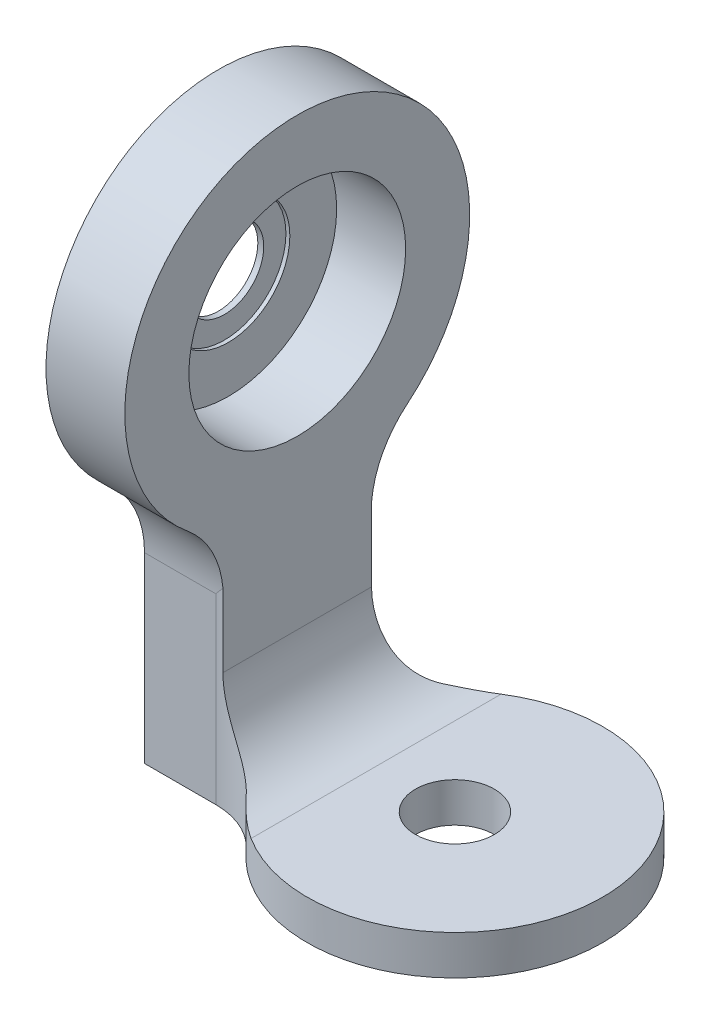
ISO-10303-21;
HEADER;
FILE_DESCRIPTION(('STEP AP214'),'2;1');
FILE_NAME('part.step','',(''),(''),'','','');
FILE_SCHEMA(('AUTOMOTIVE_DESIGN { 1 0 10303 214 1 1 1 1 }'));
ENDSEC;
DATA;
#1=APPLICATION_CONTEXT('core data for automotive mechanical design processes');
#2=APPLICATION_PROTOCOL_DEFINITION('international standard','automotive_design',2000,#1);
#3=PRODUCT_CONTEXT('',#1,'mechanical');
#4=PRODUCT('Part','Part','',(#3));
#5=PRODUCT_RELATED_PRODUCT_CATEGORY('part','',(#4));
#6=PRODUCT_DEFINITION_FORMATION('','',#4);
#7=PRODUCT_DEFINITION_CONTEXT('part definition',#1,'design');
#8=PRODUCT_DEFINITION('design','',#6,#7);
#9=PRODUCT_DEFINITION_SHAPE('','',#8);
#10=(LENGTH_UNIT() NAMED_UNIT(*) SI_UNIT(.MILLI.,.METRE.));
#11=(NAMED_UNIT(*) PLANE_ANGLE_UNIT() SI_UNIT($,.RADIAN.));
#12=(NAMED_UNIT(*) SI_UNIT($,.STERADIAN.) SOLID_ANGLE_UNIT());
#13=UNCERTAINTY_MEASURE_WITH_UNIT(LENGTH_MEASURE(1.E-05),#10,'distance_accuracy_value','');
#14=(GEOMETRIC_REPRESENTATION_CONTEXT(3) GLOBAL_UNCERTAINTY_ASSIGNED_CONTEXT((#13)) GLOBAL_UNIT_ASSIGNED_CONTEXT((#10,
#11,#12)) REPRESENTATION_CONTEXT('',''));
#15=CARTESIAN_POINT('',(0.,0.,0.));
#16=DIRECTION('',(0.,0.,1.));
#17=DIRECTION('',(1.,0.,0.));
#18=AXIS2_PLACEMENT_3D('',#15,#16,#17);
#19=CARTESIAN_POINT('',(-24.,40.,0.));
#20=DIRECTION('',(1.,0.,0.));
#21=DIRECTION('',(0.,0.,-1.));
#22=AXIS2_PLACEMENT_3D('',#19,#20,#21);
#23=CYLINDRICAL_SURFACE('',#22,4.);
#24=CARTESIAN_POINT('',(-24.,40.,0.));
#25=DIRECTION('',(1.,0.,0.));
#26=DIRECTION('',(0.,0.,-1.));
#27=AXIS2_PLACEMENT_3D('',#24,#25,#26);
#28=CIRCLE('',#27,4.);
#29=CARTESIAN_POINT('',(-24.,40.,-4.));
#30=VERTEX_POINT('',#29);
#31=EDGE_CURVE('E284',#30,#30,#28,.T.);
#32=ORIENTED_EDGE('',*,*,#31,.F.);
#33=EDGE_LOOP('',(#32));
#34=FACE_BOUND('',#33,.T.);
#35=CARTESIAN_POINT('',(-23.4,40.,0.));
#36=DIRECTION('',(1.,0.,0.));
#37=DIRECTION('',(0.,0.,-1.));
#38=AXIS2_PLACEMENT_3D('',#35,#36,#37);
#39=CIRCLE('',#38,4.);
#40=CARTESIAN_POINT('',(-23.4,40.,-4.));
#41=VERTEX_POINT('',#40);
#42=EDGE_CURVE('E41',#41,#41,#39,.F.);
#43=ORIENTED_EDGE('',*,*,#42,.F.);
#44=EDGE_LOOP('',(#43));
#45=FACE_BOUND('',#44,.T.);
#46=ADVANCED_FACE('F36',(#34,#45),#23,.F.);
#47=CARTESIAN_POINT('',(0.,4.,0.));
#48=DIRECTION('',(0.,-1.,0.));
#49=DIRECTION('',(0.,0.,-1.));
#50=AXIS2_PLACEMENT_3D('',#47,#48,#49);
#51=CYLINDRICAL_SURFACE('',#50,15.);
#52=CARTESIAN_POINT('',(0.,4.,0.));
#53=DIRECTION('',(0.,1.,0.));
#54=DIRECTION('',(0.,0.,1.));
#55=AXIS2_PLACEMENT_3D('',#52,#53,#54);
#56=CIRCLE('',#55,15.);
#57=CARTESIAN_POINT('',(-8.,4.,12.6885775404495));
#58=VERTEX_POINT('',#57);
#59=CARTESIAN_POINT('',(-8.,4.,-12.6885775404495));
#60=VERTEX_POINT('',#59);
#61=EDGE_CURVE('E154',#58,#60,#56,.T.);
#62=ORIENTED_EDGE('',*,*,#61,.F.);
#63=CARTESIAN_POINT('',(-8.,4.,12.6885775404495));
#64=CARTESIAN_POINT('',(-8.15040848868833,4.00000108823248,12.5937532063186));
#65=CARTESIAN_POINT('',(-8.29907485720502,4.00424187961463,12.4962760467535));
#66=CARTESIAN_POINT('',(-8.5925067665749,4.02061861524083,12.2963533070113));
#67=CARTESIAN_POINT('',(-8.73727374334673,4.03275161068145,12.1939095957369));
#68=CARTESIAN_POINT('',(-9.16247755364884,4.0798094444238,11.881574404678));
#69=CARTESIAN_POINT('',(-9.43677123586311,4.12541732094989,11.6648122848871));
#70=CARTESIAN_POINT('',(-9.96638352652898,4.24069200608395,11.2156943792696));
#71=CARTESIAN_POINT('',(-10.2217109361145,4.31034756974564,10.9833459226168));
#72=CARTESIAN_POINT('',(-10.7150795755123,4.4703192384856,10.5027150935739));
#73=CARTESIAN_POINT('',(-10.9529302158422,4.56082823226295,10.2543005951884));
#74=CARTESIAN_POINT('',(-11.180339887499,4.65932985348183,10.));
#75=B_SPLINE_CURVE_WITH_KNOTS('',3,(#63,#64,#65,#66,#67,#68,#69,#70,#71,#72,#73,#74),
.UNSPECIFIED.,.F.,.F.,(4,2,2,2,2,4),(0.,0.533232518757135,1.06626591754886,2.12190739512482,
3.17705591097567,4.24238666324427),.UNSPECIFIED.);
#76=CARTESIAN_POINT('',(-11.180339887499,4.65932985348183,10.));
#77=VERTEX_POINT('',#76);
#78=EDGE_CURVE('E46',#58,#77,#75,.T.);
#79=ORIENTED_EDGE('',*,*,#78,.T.);
#80=DIRECTION('',(0.,-1.,0.));
#81=VECTOR('',#80,1.);
#82=CARTESIAN_POINT('',(-11.180339887499,4.,10.));
#83=LINE('',#82,#81);
#84=CARTESIAN_POINT('',(-11.180339887499,0.,10.));
#85=VERTEX_POINT('',#84);
#86=EDGE_CURVE('E52',#77,#85,#83,.T.);
#87=ORIENTED_EDGE('',*,*,#86,.T.);
#88=CARTESIAN_POINT('',(0.,0.,0.));
#89=DIRECTION('',(0.,1.,0.));
#90=DIRECTION('',(0.,0.,1.));
#91=AXIS2_PLACEMENT_3D('',#88,#89,#90);
#92=CIRCLE('',#91,15.);
#93=CARTESIAN_POINT('',(-11.1803398874989,0.,-10.));
#94=VERTEX_POINT('',#93);
#95=EDGE_CURVE('E146',#85,#94,#92,.T.);
#96=ORIENTED_EDGE('',*,*,#95,.T.);
#97=DIRECTION('',(0.,-1.,0.));
#98=VECTOR('',#97,1.);
#99=CARTESIAN_POINT('',(-11.1803398874989,4.,-10.));
#100=LINE('',#99,#98);
#101=CARTESIAN_POINT('',(-11.1803398874989,4.65932985348182,-10.));
#102=VERTEX_POINT('',#101);
#103=EDGE_CURVE('E60',#94,#102,#100,.F.);
#104=ORIENTED_EDGE('',*,*,#103,.T.);
#105=CARTESIAN_POINT('',(-11.1803398874989,4.65932985348182,-10.));
#106=CARTESIAN_POINT('',(-10.9529302158422,4.56082823226295,-10.2543005951884));
#107=CARTESIAN_POINT('',(-10.7150795755123,4.4703192384856,-10.5027150935739));
#108=CARTESIAN_POINT('',(-10.2217109361145,4.31034756974564,-10.9833459226168));
#109=CARTESIAN_POINT('',(-9.96638352652898,4.24069200608396,-11.2156943792696));
#110=CARTESIAN_POINT('',(-9.43677123586311,4.12541732094989,-11.6648122848871));
#111=CARTESIAN_POINT('',(-9.16247755364885,4.07980944442379,-11.881574404678));
#112=CARTESIAN_POINT('',(-8.73727374334675,4.03275161068145,-12.1939095957369));
#113=CARTESIAN_POINT('',(-8.59250676657492,4.02061861524084,-12.2963533070113));
#114=CARTESIAN_POINT('',(-8.29907485720504,4.00424187961462,-12.4962760467535));
#115=CARTESIAN_POINT('',(-8.15040848868836,4.00000108823245,-12.5937532063186));
#116=CARTESIAN_POINT('',(-8.00000000000004,3.9999999999999,-12.6885775404495));
#117=B_SPLINE_CURVE_WITH_KNOTS('',3,(#105,#106,#107,#108,#109,#110,#111,#112,#113,#114,#115,
#116),.UNSPECIFIED.,.F.,.F.,(4,2,2,2,2,4),(0.,1.06533075226859,2.12047926811943,
3.17612074569538,3.70915414448709,4.24238666324422),.UNSPECIFIED.);
#118=EDGE_CURVE('E221',#102,#60,#117,.T.);
#119=ORIENTED_EDGE('',*,*,#118,.T.);
#120=EDGE_LOOP('',(#62,#79,#87,#96,#104,#119));
#121=FACE_BOUND('',#120,.T.);
#122=ADVANCED_FACE('F226',(#121),#51,.T.);
#123=CARTESIAN_POINT('',(0.,4.,-7.5));
#124=DIRECTION('',(0.,0.,-1.));
#125=DIRECTION('',(-1.,0.,0.));
#126=AXIS2_PLACEMENT_3D('',#123,#124,#125);
#127=PLANE('',#126);
#128=DIRECTION('',(0.,-1.,0.));
#129=VECTOR('',#128,1.);
#130=CARTESIAN_POINT('',(-24.,4.,-7.5));
#131=LINE('',#130,#129);
#132=CARTESIAN_POINT('',(-24.,18.5292342638142,-7.5));
#133=VERTEX_POINT('',#132);
#134=CARTESIAN_POINT('',(-24.,0.,-7.5));
#135=VERTEX_POINT('',#134);
#136=EDGE_CURVE('E121',#133,#135,#131,.T.);
#137=ORIENTED_EDGE('',*,*,#136,.F.);
#138=DIRECTION('',(1.,0.,0.));
#139=VECTOR('',#138,1.);
#140=CARTESIAN_POINT('',(-16.7705098312484,18.5292342638142,-7.5));
#141=LINE('',#140,#139);
#142=CARTESIAN_POINT('',(-16.7705098312484,18.5292342638142,-7.5));
#143=VERTEX_POINT('',#142);
#144=EDGE_CURVE('E176',#133,#143,#141,.T.);
#145=ORIENTED_EDGE('',*,*,#144,.T.);
#146=DIRECTION('',(0.,-1.,0.));
#147=VECTOR('',#146,1.);
#148=CARTESIAN_POINT('',(-16.7705098312484,4.,-7.5));
#149=LINE('',#148,#147);
#150=CARTESIAN_POINT('',(-16.7705098312484,0.,-7.5));
#151=VERTEX_POINT('',#150);
#152=EDGE_CURVE('E144',#143,#151,#149,.T.);
#153=ORIENTED_EDGE('',*,*,#152,.T.);
#154=DIRECTION('',(1.,0.,0.));
#155=VECTOR('',#154,1.);
#156=CARTESIAN_POINT('',(0.,0.,-7.5));
#157=LINE('',#156,#155);
#158=EDGE_CURVE('E138',#135,#151,#157,.T.);
#159=ORIENTED_EDGE('',*,*,#158,.F.);
#160=EDGE_LOOP('',(#137,#145,#153,#159));
#161=FACE_BOUND('',#160,.T.);
#162=ADVANCED_FACE('F142',(#161),#127,.T.);
#163=CARTESIAN_POINT('',(-24.,4.,0.));
#164=DIRECTION('',(1.,0.,0.));
#165=DIRECTION('',(0.,0.,-1.));
#166=AXIS2_PLACEMENT_3D('',#163,#164,#165);
#167=PLANE('',#166);
#168=ORIENTED_EDGE('',*,*,#31,.T.);
#169=EDGE_LOOP('',(#168));
#170=FACE_BOUND('',#169,.T.);
#171=DIRECTION('',(0.,0.,1.));
#172=VECTOR('',#171,1.);
#173=CARTESIAN_POINT('',(-24.,0.,0.));
#174=LINE('',#173,#172);
#175=CARTESIAN_POINT('',(-24.,0.,7.5));
#176=VERTEX_POINT('',#175);
#177=EDGE_CURVE('E125',#135,#176,#174,.T.);
#178=ORIENTED_EDGE('',*,*,#177,.T.);
#179=DIRECTION('',(0.,-1.,0.));
#180=VECTOR('',#179,1.);
#181=CARTESIAN_POINT('',(-24.,4.,7.5));
#182=LINE('',#181,#180);
#183=CARTESIAN_POINT('',(-24.,18.5292342638142,7.5));
#184=VERTEX_POINT('',#183);
#185=EDGE_CURVE('E132',#184,#176,#182,.T.);
#186=ORIENTED_EDGE('',*,*,#185,.F.);
#187=CARTESIAN_POINT('',(-24.,18.5292342638142,17.5));
#188=DIRECTION('',(1.,0.,0.));
#189=DIRECTION('',(0.,0.,-1.));
#190=AXIS2_PLACEMENT_3D('',#187,#188,#189);
#191=CIRCLE('',#190,10.);
#192=CARTESIAN_POINT('',(-24.,26.2431264222129,11.1363636363636));
#193=VERTEX_POINT('',#192);
#194=EDGE_CURVE('E466',#184,#193,#191,.T.);
#195=ORIENTED_EDGE('',*,*,#194,.T.);
#196=CARTESIAN_POINT('',(-24.,39.7424376994106,0.));
#197=DIRECTION('',(-1.,0.,0.));
#198=DIRECTION('',(0.,0.,1.));
#199=AXIS2_PLACEMENT_3D('',#196,#197,#198);
#200=CIRCLE('',#199,17.5);
#201=CARTESIAN_POINT('',(-24.,26.2431264222129,-11.1363636363636));
#202=VERTEX_POINT('',#201);
#203=EDGE_CURVE('E296',#193,#202,#200,.T.);
#204=ORIENTED_EDGE('',*,*,#203,.T.);
#205=CARTESIAN_POINT('',(-24.,18.5292342638142,-17.5));
#206=DIRECTION('',(1.,0.,0.));
#207=DIRECTION('',(0.,0.,-1.));
#208=AXIS2_PLACEMENT_3D('',#205,#206,#207);
#209=CIRCLE('',#208,10.);
#210=EDGE_CURVE('E128',#202,#133,#209,.T.);
#211=ORIENTED_EDGE('',*,*,#210,.T.);
#212=ORIENTED_EDGE('',*,*,#136,.T.);
#213=EDGE_LOOP('',(#178,#186,#195,#204,#211,#212));
#214=FACE_BOUND('',#213,.T.);
#215=ADVANCED_FACE('F123',(#170,#214),#167,.F.);
#216=CARTESIAN_POINT('',(0.,4.,0.));
#217=DIRECTION('',(0.,-1.,0.));
#218=DIRECTION('',(0.,0.,-1.));
#219=AXIS2_PLACEMENT_3D('',#216,#217,#218);
#220=CYLINDRICAL_SURFACE('',#219,4.);
#221=CARTESIAN_POINT('',(0.,4.,0.));
#222=DIRECTION('',(0.,1.,0.));
#223=DIRECTION('',(0.,0.,1.));
#224=AXIS2_PLACEMENT_3D('',#221,#222,#223);
#225=CIRCLE('',#224,4.);
#226=CARTESIAN_POINT('',(0.,4.,4.00000000000001));
#227=VERTEX_POINT('',#226);
#228=EDGE_CURVE('E153',#227,#227,#225,.T.);
#229=ORIENTED_EDGE('',*,*,#228,.T.);
#230=EDGE_LOOP('',(#229));
#231=FACE_BOUND('',#230,.T.);
#232=CARTESIAN_POINT('',(0.,0.,0.));
#233=DIRECTION('',(0.,1.,0.));
#234=DIRECTION('',(0.,0.,1.));
#235=AXIS2_PLACEMENT_3D('',#232,#233,#234);
#236=CIRCLE('',#235,4.);
#237=CARTESIAN_POINT('',(0.,0.,4.00000000000001));
#238=VERTEX_POINT('',#237);
#239=EDGE_CURVE('E148',#238,#238,#236,.T.);
#240=ORIENTED_EDGE('',*,*,#239,.F.);
#241=EDGE_LOOP('',(#240));
#242=FACE_BOUND('',#241,.T.);
#243=ADVANCED_FACE('F210',(#231,#242),#220,.F.);
#244=CARTESIAN_POINT('',(0.,4.,7.5));
#245=DIRECTION('',(0.,0.,-1.));
#246=DIRECTION('',(-1.,0.,0.));
#247=AXIS2_PLACEMENT_3D('',#244,#245,#246);
#248=PLANE('',#247);
#249=DIRECTION('',(0.,1.,0.));
#250=VECTOR('',#249,1.);
#251=CARTESIAN_POINT('',(-16.7705098312484,4.,7.5));
#252=LINE('',#251,#250);
#253=CARTESIAN_POINT('',(-16.7705098312484,0.,7.5));
#254=VERTEX_POINT('',#253);
#255=CARTESIAN_POINT('',(-16.7705098312484,18.5292342638142,7.5));
#256=VERTEX_POINT('',#255);
#257=EDGE_CURVE('E158',#254,#256,#252,.T.);
#258=ORIENTED_EDGE('',*,*,#257,.T.);
#259=DIRECTION('',(-1.,0.,0.));
#260=VECTOR('',#259,1.);
#261=CARTESIAN_POINT('',(0.,18.5292342638142,7.5));
#262=LINE('',#261,#260);
#263=EDGE_CURVE('E186',#256,#184,#262,.T.);
#264=ORIENTED_EDGE('',*,*,#263,.T.);
#265=ORIENTED_EDGE('',*,*,#185,.T.);
#266=DIRECTION('',(1.,0.,0.));
#267=VECTOR('',#266,1.);
#268=CARTESIAN_POINT('',(0.,0.,7.5));
#269=LINE('',#268,#267);
#270=EDGE_CURVE('E140',#176,#254,#269,.T.);
#271=ORIENTED_EDGE('',*,*,#270,.T.);
#272=EDGE_LOOP('',(#258,#264,#265,#271));
#273=FACE_BOUND('',#272,.T.);
#274=ADVANCED_FACE('F236',(#273),#248,.F.);
#275=CARTESIAN_POINT('',(0.,4.,0.));
#276=DIRECTION('',(0.,1.,0.));
#277=DIRECTION('',(0.,0.,1.));
#278=AXIS2_PLACEMENT_3D('',#275,#276,#277);
#279=PLANE('',#278);
#280=ORIENTED_EDGE('',*,*,#61,.T.);
#281=DIRECTION('',(0.,0.,-1.));
#282=VECTOR('',#281,1.);
#283=CARTESIAN_POINT('',(-8.,4.,0.));
#284=LINE('',#283,#282);
#285=EDGE_CURVE('E474',#60,#58,#284,.F.);
#286=ORIENTED_EDGE('',*,*,#285,.T.);
#287=EDGE_LOOP('',(#280,#286));
#288=FACE_BOUND('',#287,.T.);
#289=ORIENTED_EDGE('',*,*,#228,.F.);
#290=EDGE_LOOP('',(#289));
#291=FACE_BOUND('',#290,.T.);
#292=ADVANCED_FACE('F239',(#288,#291),#279,.T.);
#293=CARTESIAN_POINT('',(0.,0.,0.));
#294=DIRECTION('',(0.,1.,0.));
#295=DIRECTION('',(0.,0.,1.));
#296=AXIS2_PLACEMENT_3D('',#293,#294,#295);
#297=PLANE('',#296);
#298=ORIENTED_EDGE('',*,*,#239,.T.);
#299=EDGE_LOOP('',(#298));
#300=FACE_BOUND('',#299,.T.);
#301=ORIENTED_EDGE('',*,*,#95,.F.);
#302=CARTESIAN_POINT('',(-16.7705098312484,0.,15.));
#303=DIRECTION('',(0.,1.,0.));
#304=DIRECTION('',(0.,0.,1.));
#305=AXIS2_PLACEMENT_3D('',#302,#303,#304);
#306=CIRCLE('',#305,7.5);
#307=EDGE_CURVE('E162',#85,#254,#306,.T.);
#308=ORIENTED_EDGE('',*,*,#307,.T.);
#309=ORIENTED_EDGE('',*,*,#270,.F.);
#310=ORIENTED_EDGE('',*,*,#177,.F.);
#311=ORIENTED_EDGE('',*,*,#158,.T.);
#312=CARTESIAN_POINT('',(-16.7705098312484,0.,-15.));
#313=DIRECTION('',(0.,1.,0.));
#314=DIRECTION('',(0.,0.,1.));
#315=AXIS2_PLACEMENT_3D('',#312,#313,#314);
#316=CIRCLE('',#315,7.5);
#317=EDGE_CURVE('E167',#151,#94,#316,.T.);
#318=ORIENTED_EDGE('',*,*,#317,.T.);
#319=EDGE_LOOP('',(#301,#308,#309,#310,#311,#318));
#320=FACE_BOUND('',#319,.T.);
#321=ADVANCED_FACE('F137',(#300,#320),#297,.F.);
#322=CARTESIAN_POINT('',(-16.,39.7424376994106,0.));
#323=DIRECTION('',(-1.,0.,0.));
#324=DIRECTION('',(0.,0.,1.));
#325=AXIS2_PLACEMENT_3D('',#322,#323,#324);
#326=CYLINDRICAL_SURFACE('',#325,17.5);
#327=CARTESIAN_POINT('',(-16.,39.7424376994106,0.));
#328=DIRECTION('',(-1.,0.,0.));
#329=DIRECTION('',(0.,0.,1.));
#330=AXIS2_PLACEMENT_3D('',#327,#328,#329);
#331=CIRCLE('',#330,17.5);
#332=CARTESIAN_POINT('',(-16.,26.2431264222129,11.1363636363636));
#333=VERTEX_POINT('',#332);
#334=CARTESIAN_POINT('',(-16.,26.2431264222129,-11.1363636363636));
#335=VERTEX_POINT('',#334);
#336=EDGE_CURVE('E299',#333,#335,#331,.T.);
#337=ORIENTED_EDGE('',*,*,#336,.T.);
#338=DIRECTION('',(-1.,0.,0.));
#339=VECTOR('',#338,1.);
#340=CARTESIAN_POINT('',(-16.,26.2431264222129,-11.1363636363636));
#341=LINE('',#340,#339);
#342=EDGE_CURVE('E173',#335,#202,#341,.T.);
#343=ORIENTED_EDGE('',*,*,#342,.T.);
#344=ORIENTED_EDGE('',*,*,#203,.F.);
#345=DIRECTION('',(-1.,0.,0.));
#346=VECTOR('',#345,1.);
#347=CARTESIAN_POINT('',(-16.,26.2431264222129,11.1363636363636));
#348=LINE('',#347,#346);
#349=EDGE_CURVE('E171',#193,#333,#348,.F.);
#350=ORIENTED_EDGE('',*,*,#349,.T.);
#351=EDGE_LOOP('',(#337,#343,#344,#350));
#352=FACE_BOUND('',#351,.T.);
#353=ADVANCED_FACE('F243',(#352),#326,.T.);
#354=CARTESIAN_POINT('',(-16.,0.,0.));
#355=DIRECTION('',(-1.,0.,0.));
#356=DIRECTION('',(0.,0.,1.));
#357=AXIS2_PLACEMENT_3D('',#354,#355,#356);
#358=PLANE('',#357);
#359=CARTESIAN_POINT('',(-16.,40.,0.));
#360=DIRECTION('',(-1.,0.,0.));
#361=DIRECTION('',(0.,0.,1.));
#362=AXIS2_PLACEMENT_3D('',#359,#360,#361);
#363=CIRCLE('',#362,11.);
#364=CARTESIAN_POINT('',(-16.,40.,11.));
#365=VERTEX_POINT('',#364);
#366=EDGE_CURVE('E286',#365,#365,#363,.T.);
#367=ORIENTED_EDGE('',*,*,#366,.T.);
#368=EDGE_LOOP('',(#367));
#369=FACE_BOUND('',#368,.T.);
#370=DIRECTION('',(0.,-1.,0.));
#371=VECTOR('',#370,1.);
#372=CARTESIAN_POINT('',(-16.,23.9499342576539,7.53968401473842));
#373=LINE('',#372,#371);
#374=CARTESIAN_POINT('',(-16.,19.4192373389452,7.53968401473842));
#375=VERTEX_POINT('',#374);
#376=CARTESIAN_POINT('',(-16.,12.,7.53968401473842));
#377=VERTEX_POINT('',#376);
#378=EDGE_CURVE('E164',#375,#377,#373,.T.);
#379=ORIENTED_EDGE('',*,*,#378,.T.);
#380=DIRECTION('',(0.,0.,-1.));
#381=VECTOR('',#380,1.);
#382=CARTESIAN_POINT('',(-16.,12.,0.));
#383=LINE('',#382,#381);
#384=CARTESIAN_POINT('',(-16.,12.,-7.53968401473841));
#385=VERTEX_POINT('',#384);
#386=EDGE_CURVE('E471',#377,#385,#383,.T.);
#387=ORIENTED_EDGE('',*,*,#386,.T.);
#388=DIRECTION('',(0.,-1.,0.));
#389=VECTOR('',#388,1.);
#390=CARTESIAN_POINT('',(-16.,4.,-7.53968401473841));
#391=LINE('',#390,#389);
#392=CARTESIAN_POINT('',(-16.,19.4192373389452,-7.53968401473841));
#393=VERTEX_POINT('',#392);
#394=EDGE_CURVE('E169',#385,#393,#391,.F.);
#395=ORIENTED_EDGE('',*,*,#394,.T.);
#396=CARTESIAN_POINT('',(-16.,18.5292342638142,-17.5));
#397=DIRECTION('',(-1.,0.,0.));
#398=DIRECTION('',(0.,0.,1.));
#399=AXIS2_PLACEMENT_3D('',#396,#397,#398);
#400=CIRCLE('',#399,10.);
#401=EDGE_CURVE('E463',#393,#335,#400,.T.);
#402=ORIENTED_EDGE('',*,*,#401,.T.);
#403=ORIENTED_EDGE('',*,*,#336,.F.);
#404=CARTESIAN_POINT('',(-16.,18.5292342638142,17.5));
#405=DIRECTION('',(-1.,0.,0.));
#406=DIRECTION('',(0.,0.,1.));
#407=AXIS2_PLACEMENT_3D('',#404,#405,#406);
#408=CIRCLE('',#407,10.);
#409=EDGE_CURVE('E467',#333,#375,#408,.T.);
#410=ORIENTED_EDGE('',*,*,#409,.T.);
#411=EDGE_LOOP('',(#379,#387,#395,#402,#403,#410));
#412=FACE_BOUND('',#411,.T.);
#413=ADVANCED_FACE('F250',(#369,#412),#358,.F.);
#414=CARTESIAN_POINT('',(-23.,40.,0.));
#415=DIRECTION('',(1.,0.,0.));
#416=DIRECTION('',(0.,0.,-1.));
#417=AXIS2_PLACEMENT_3D('',#414,#415,#416);
#418=CYLINDRICAL_SURFACE('',#417,11.);
#419=CARTESIAN_POINT('',(-23.,40.,0.));
#420=DIRECTION('',(-1.,0.,0.));
#421=DIRECTION('',(0.,0.,1.));
#422=AXIS2_PLACEMENT_3D('',#419,#420,#421);
#423=CIRCLE('',#422,11.);
#424=CARTESIAN_POINT('',(-23.,40.,11.));
#425=VERTEX_POINT('',#424);
#426=EDGE_CURVE('E293',#425,#425,#423,.T.);
#427=ORIENTED_EDGE('',*,*,#426,.T.);
#428=EDGE_LOOP('',(#427));
#429=FACE_BOUND('',#428,.T.);
#430=ORIENTED_EDGE('',*,*,#366,.F.);
#431=EDGE_LOOP('',(#430));
#432=FACE_BOUND('',#431,.T.);
#433=ADVANCED_FACE('F254',(#429,#432),#418,.F.);
#434=CARTESIAN_POINT('',(-23.,40.,0.));
#435=DIRECTION('',(-1.,0.,0.));
#436=DIRECTION('',(0.,0.,1.));
#437=AXIS2_PLACEMENT_3D('',#434,#435,#436);
#438=PLANE('',#437);
#439=CARTESIAN_POINT('',(-23.,40.,0.));
#440=DIRECTION('',(1.,0.,0.));
#441=DIRECTION('',(0.,0.,-1.));
#442=AXIS2_PLACEMENT_3D('',#439,#440,#441);
#443=CIRCLE('',#442,6.25);
#444=CARTESIAN_POINT('',(-23.,40.,-6.25));
#445=VERTEX_POINT('',#444);
#446=EDGE_CURVE('E288',#445,#445,#443,.T.);
#447=ORIENTED_EDGE('',*,*,#446,.F.);
#448=EDGE_LOOP('',(#447));
#449=FACE_BOUND('',#448,.T.);
#450=ORIENTED_EDGE('',*,*,#426,.F.);
#451=EDGE_LOOP('',(#450));
#452=FACE_BOUND('',#451,.T.);
#453=ADVANCED_FACE('F209',(#449,#452),#438,.F.);
#454=CARTESIAN_POINT('',(-16.7705098312484,4.,15.));
#455=DIRECTION('',(0.,-1.,0.));
#456=DIRECTION('',(0.,0.,-1.));
#457=AXIS2_PLACEMENT_3D('',#454,#455,#456);
#458=CYLINDRICAL_SURFACE('',#457,7.5);
#459=ORIENTED_EDGE('',*,*,#378,.F.);
#460=CARTESIAN_POINT('',(-16.,19.4192373389452,7.53968401473842));
#461=CARTESIAN_POINT('',(-16.2522786368458,19.1277361200948,7.51367697015977));
#462=CARTESIAN_POINT('',(-16.5047508896948,18.8361079548971,7.50045277477326));
#463=CARTESIAN_POINT('',(-16.7617810583475,18.5393133547146,7.50000380520215));
#464=CARTESIAN_POINT('',(-16.7661454159147,18.5342738282021,7.49999999567585));
#465=CARTESIAN_POINT('',(-16.7705098312484,18.5292342638142,7.5));
#466=B_SPLINE_CURVE_WITH_KNOTS('',3,(#460,#461,#462,#463,#464,#465),.UNSPECIFIED.,.F.,.F.,(4,2,
4),(0.,1.15787604727368,1.17787605053898),.UNSPECIFIED.);
#467=EDGE_CURVE('E199',#375,#256,#466,.T.);
#468=ORIENTED_EDGE('',*,*,#467,.T.);
#469=ORIENTED_EDGE('',*,*,#257,.F.);
#470=ORIENTED_EDGE('',*,*,#307,.F.);
#471=ORIENTED_EDGE('',*,*,#86,.F.);
#472=CARTESIAN_POINT('',(-11.180339887499,4.65932985348183,10.));
#473=CARTESIAN_POINT('',(-11.2360517761755,4.68346707295004,9.93771021000165));
#474=CARTESIAN_POINT('',(-11.292586863603,4.70871431236351,9.87659985065098));
#475=CARTESIAN_POINT('',(-11.4071326200722,4.76153142814061,9.75680907838393));
#476=CARTESIAN_POINT('',(-11.4651433538177,4.78910140647402,9.69812877231734));
#477=CARTESIAN_POINT('',(-11.6411071647579,4.87543713245961,9.52586539916806));
#478=CARTESIAN_POINT('',(-11.7610091992856,4.93783607777209,9.41604055573054));
#479=CARTESIAN_POINT('',(-12.0037717052503,5.07259002568687,9.20744169757314));
#480=CARTESIAN_POINT('',(-12.1266185805106,5.14490462242096,9.10862564246997));
#481=CARTESIAN_POINT('',(-12.3739248705193,5.29999445318269,8.92183844827177));
#482=CARTESIAN_POINT('',(-12.4983840898244,5.38276842981103,8.83386600809286));
#483=CARTESIAN_POINT('',(-12.7472970057985,5.55900117133559,8.6686399166609));
#484=CARTESIAN_POINT('',(-12.8717502596104,5.65247956794988,8.5914065539464));
#485=CARTESIAN_POINT('',(-13.1185918624347,5.8497980681782,8.44760317980793));
#486=CARTESIAN_POINT('',(-13.2409800808291,5.95363882438315,8.38103384066147));
#487=CARTESIAN_POINT('',(-13.4819450487431,6.17122426414924,8.25806847473332));
#488=CARTESIAN_POINT('',(-13.6005224765286,6.28496717175336,8.20167062923845));
#489=CARTESIAN_POINT('',(-13.8323552086435,6.52176217860709,8.09830741502626));
#490=CARTESIAN_POINT('',(-13.945610526158,6.64481425479228,8.05134202294011));
#491=CARTESIAN_POINT('',(-14.1656124794407,6.89964762634626,7.96590759326907));
#492=CARTESIAN_POINT('',(-14.2723512847918,7.03143904148518,7.92744863721954));
#493=CARTESIAN_POINT('',(-14.4780779959911,7.30281974763036,7.85811349855635));
#494=CARTESIAN_POINT('',(-14.5770658680882,7.44240907258781,7.82723734896051));
#495=CARTESIAN_POINT('',(-14.7664883912679,7.72868613945448,7.77202363517802));
#496=CARTESIAN_POINT('',(-14.8569152799821,7.8753801445506,7.7476919688627));
#497=CARTESIAN_POINT('',(-15.028415790613,8.17492922866602,7.70459546443915));
#498=CARTESIAN_POINT('',(-15.1094884649913,8.32778492972402,7.68583118997981));
#499=CARTESIAN_POINT('',(-15.271845949665,8.65953019765936,7.65072793326275));
#500=CARTESIAN_POINT('',(-15.3517248780138,8.83917840317643,7.63504343663507));
#501=CARTESIAN_POINT('',(-15.4981396187734,9.20418459003353,7.60834164411741));
#502=CARTESIAN_POINT('',(-15.5646734234549,9.38954342568686,7.59732505022081));
#503=CARTESIAN_POINT('',(-15.6838988490974,9.76473230840438,7.5788871422505));
#504=CARTESIAN_POINT('',(-15.7365973225912,9.95456009107253,7.57146404680135));
#505=CARTESIAN_POINT('',(-15.8278474926651,10.3376025891132,7.55933449933174));
#506=CARTESIAN_POINT('',(-15.8664030688105,10.5308163604084,7.55462730210474));
#507=CARTESIAN_POINT('',(-15.9318070566807,10.9360374134486,7.54696256578335));
#508=CARTESIAN_POINT('',(-15.9573932378856,11.1482549150289,7.54418615914063));
#509=CARTESIAN_POINT('',(-15.9829613027814,11.4673634046471,7.54145936452034));
#510=CARTESIAN_POINT('',(-15.9893487871139,11.573773429719,7.54079002919514));
#511=CARTESIAN_POINT('',(-15.9978684250651,11.7867847748921,7.53990375561339));
#512=CARTESIAN_POINT('',(-15.9999998129516,11.8933861259631,7.53968689876385));
#513=CARTESIAN_POINT('',(-16.,12.,7.53968401473842));
#514=B_SPLINE_CURVE_WITH_KNOTS('',3,(#472,#473,#474,#475,#476,#477,#478,#479,#480,#481,#482,
#483,#484,#485,#486,#487,#488,#489,#490,#491,#492,#493,#494,#495,#496,#497,#498,#499,#500,#501,
#502,#503,#504,#505,#506,#507,#508,#509,#510,#511,#512,#513),.UNSPECIFIED.,.F.,.F.,(4,2,2,2,2,2,
2,2,2,2,2,2,2,2,2,2,2,2,2,2,4),(0.,0.260917265002457,0.521845990421236,1.04362269919536,
1.56333310399754,2.08298108990881,2.60359784342699,3.12424740457281,3.64480377851558,
4.16535886276838,4.6865276239844,5.2076986544855,5.72933780113592,6.25102974110401,
6.84210674540768,7.43327260867687,8.02414511729567,8.61485542111768,9.25540547827316,
9.57514300520719,9.89493805229292),.UNSPECIFIED.);
#515=EDGE_CURVE('E11',#77,#377,#514,.T.);
#516=ORIENTED_EDGE('',*,*,#515,.T.);
#517=EDGE_LOOP('',(#459,#468,#469,#470,#471,#516));
#518=FACE_BOUND('',#517,.T.);
#519=ADVANCED_FACE('F205',(#518),#458,.F.);
#520=CARTESIAN_POINT('',(-16.7705098312484,4.,-15.));
#521=DIRECTION('',(0.,-1.,0.));
#522=DIRECTION('',(0.,0.,-1.));
#523=AXIS2_PLACEMENT_3D('',#520,#521,#522);
#524=CYLINDRICAL_SURFACE('',#523,7.5);
#525=ORIENTED_EDGE('',*,*,#152,.F.);
#526=CARTESIAN_POINT('',(-16.,19.4192373389452,-7.53968401473841));
#527=CARTESIAN_POINT('',(-16.2522786368454,19.1277361200944,-7.51367697015977));
#528=CARTESIAN_POINT('',(-16.5047508896944,18.8361079548967,-7.50045277477326));
#529=CARTESIAN_POINT('',(-16.7617810583475,18.5393133547146,-7.50000380520215));
#530=CARTESIAN_POINT('',(-16.7661454159146,18.5342738282021,-7.49999999567585));
#531=CARTESIAN_POINT('',(-16.7705098312484,18.5292342638142,-7.5));
#532=B_SPLINE_CURVE_WITH_KNOTS('',3,(#526,#527,#528,#529,#530,#531),.UNSPECIFIED.,.F.,.F.,(4,2,
4),(0.,1.15787604727364,1.17787605053895),.UNSPECIFIED.);
#533=EDGE_CURVE('E178',#143,#393,#532,.F.);
#534=ORIENTED_EDGE('',*,*,#533,.T.);
#535=ORIENTED_EDGE('',*,*,#394,.F.);
#536=CARTESIAN_POINT('',(-16.,12.,-7.53968401473841));
#537=CARTESIAN_POINT('',(-15.9999999325842,11.8903060682248,-7.53968730314166));
#538=CARTESIAN_POINT('',(-15.9977435097838,11.7806249153533,-7.53991664311157));
#539=CARTESIAN_POINT('',(-15.9887238288309,11.5614525730423,-7.54085525782105));
#540=CARTESIAN_POINT('',(-15.9819606696031,11.4519613794861,-7.54156452202609));
#541=CARTESIAN_POINT('',(-15.9549219151498,11.1240383513854,-7.54445372957825));
#542=CARTESIAN_POINT('',(-15.9278970402114,10.906130658035,-7.5473950753017));
#543=CARTESIAN_POINT('',(-15.8558938379817,10.4724295656919,-7.55588894578482));
#544=CARTESIAN_POINT('',(-15.8108400028259,10.2566490199546,-7.56145247025234));
#545=CARTESIAN_POINT('',(-15.7031191936386,9.82964812325983,-7.57614443084062));
#546=CARTESIAN_POINT('',(-15.640452773954,9.61842762900232,-7.58527275476469));
#547=CARTESIAN_POINT('',(-15.4979013913238,9.20178151835656,-7.60840432185964));
#548=CARTESIAN_POINT('',(-15.4179901060265,8.99636530975496,-7.62241503778033));
#549=CARTESIAN_POINT('',(-15.2417283937623,8.59327951219795,-7.65691569660847));
#550=CARTESIAN_POINT('',(-15.1453793970905,8.39560925108273,-7.67740507591997));
#551=CARTESIAN_POINT('',(-14.9374587265096,8.01007243553888,-7.72667150264617));
#552=CARTESIAN_POINT('',(-14.8259211463859,7.82218519115097,-7.75543014436629));
#553=CARTESIAN_POINT('',(-14.5888129772908,7.45744162904667,-7.8232742251559));
#554=CARTESIAN_POINT('',(-14.4632438191809,7.28058418943331,-7.86235861181741));
#555=CARTESIAN_POINT('',(-14.2073364140785,6.94922928661888,-7.95036247003691));
#556=CARTESIAN_POINT('',(-14.0776699825739,6.79403286948911,-7.99860035453098));
#557=CARTESIAN_POINT('',(-13.8094170872609,6.49629108523614,-8.10776634656389));
#558=CARTESIAN_POINT('',(-13.6708307679386,6.35374551328089,-8.16869424858294));
#559=CARTESIAN_POINT('',(-13.387224328199,6.08254325299324,-8.30462210592774));
#560=CARTESIAN_POINT('',(-13.242207018235,5.95388058036889,-8.3796159595749));
#561=CARTESIAN_POINT('',(-12.9485363313928,5.71126028018037,-8.54470286698242));
#562=CARTESIAN_POINT('',(-12.7998837809255,5.59729934671751,-8.63479251572381));
#563=CARTESIAN_POINT('',(-12.5243696112998,5.40043010239177,-8.81588640412549));
#564=CARTESIAN_POINT('',(-12.3975786532398,5.31542728439895,-8.90473303695471));
#565=CARTESIAN_POINT('',(-12.1455711644507,5.15628416080561,-9.09366964160438));
#566=CARTESIAN_POINT('',(-12.0203545953537,5.08214359002097,-9.19375933883825));
#567=CARTESIAN_POINT('',(-11.7727506103641,4.94404118938151,-9.40544400831775));
#568=CARTESIAN_POINT('',(-11.6503812144692,4.88013408836443,-9.51709590523712));
#569=CARTESIAN_POINT('',(-11.4708367573677,4.79182754412136,-9.69241308060301));
#570=CARTESIAN_POINT('',(-11.4116481610707,4.76364732766776,-9.75216840082547));
#571=CARTESIAN_POINT('',(-11.2948011152221,4.70970343357272,-9.87420713391106));
#572=CARTESIAN_POINT('',(-11.2371425992681,4.68393965093955,-9.93649043676716));
#573=CARTESIAN_POINT('',(-11.1803398874989,4.65932985348182,-10.));
#574=B_SPLINE_CURVE_WITH_KNOTS('',3,(#536,#537,#538,#539,#540,#541,#542,#543,#544,#545,#546,
#547,#548,#549,#550,#551,#552,#553,#554,#555,#556,#557,#558,#559,#560,#561,#562,#563,#564,#565,
#566,#567,#568,#569,#570,#571,#572,#573),.UNSPECIFIED.,.F.,.F.,(4,2,2,2,2,2,2,2,2,2,2,2,2,2,2,2,
2,2,4),(0.,0.329032788226553,0.658058354289515,1.31603049736129,1.97678765610934,
2.63752402019781,3.2992761492023,3.9609707264812,4.62120375832686,5.28136952465027,
5.90418323905216,6.52698686752724,7.14952095183264,7.77191480543405,8.30109668302089,
8.83026563933851,9.36217634779658,9.62821282184429,9.89423773150297),.UNSPECIFIED.);
#575=EDGE_CURVE('E475',#385,#102,#574,.T.);
#576=ORIENTED_EDGE('',*,*,#575,.T.);
#577=ORIENTED_EDGE('',*,*,#103,.F.);
#578=ORIENTED_EDGE('',*,*,#317,.F.);
#579=EDGE_LOOP('',(#525,#534,#535,#576,#577,#578));
#580=FACE_BOUND('',#579,.T.);
#581=ADVANCED_FACE('F188',(#580),#524,.F.);
#582=CARTESIAN_POINT('',(-16.,18.5292342638142,-17.5));
#583=DIRECTION('',(-1.,0.,0.));
#584=DIRECTION('',(0.,0.,1.));
#585=AXIS2_PLACEMENT_3D('',#582,#583,#584);
#586=CYLINDRICAL_SURFACE('',#585,10.);
#587=ORIENTED_EDGE('',*,*,#533,.F.);
#588=ORIENTED_EDGE('',*,*,#144,.F.);
#589=ORIENTED_EDGE('',*,*,#210,.F.);
#590=ORIENTED_EDGE('',*,*,#342,.F.);
#591=ORIENTED_EDGE('',*,*,#401,.F.);
#592=EDGE_LOOP('',(#587,#588,#589,#590,#591));
#593=FACE_BOUND('',#592,.T.);
#594=ADVANCED_FACE('F191',(#593),#586,.F.);
#595=CARTESIAN_POINT('',(-16.,18.5292342638142,17.5));
#596=DIRECTION('',(-1.,0.,0.));
#597=DIRECTION('',(0.,0.,1.));
#598=AXIS2_PLACEMENT_3D('',#595,#596,#597);
#599=CYLINDRICAL_SURFACE('',#598,10.);
#600=ORIENTED_EDGE('',*,*,#409,.F.);
#601=ORIENTED_EDGE('',*,*,#349,.F.);
#602=ORIENTED_EDGE('',*,*,#194,.F.);
#603=ORIENTED_EDGE('',*,*,#263,.F.);
#604=ORIENTED_EDGE('',*,*,#467,.F.);
#605=EDGE_LOOP('',(#600,#601,#602,#603,#604));
#606=FACE_BOUND('',#605,.T.);
#607=ADVANCED_FACE('F194',(#606),#599,.F.);
#608=CARTESIAN_POINT('',(-8.,12.,0.));
#609=DIRECTION('',(0.,0.,-1.));
#610=DIRECTION('',(-1.,0.,0.));
#611=AXIS2_PLACEMENT_3D('',#608,#609,#610);
#612=CYLINDRICAL_SURFACE('',#611,8.);
#613=ORIENTED_EDGE('',*,*,#78,.F.);
#614=ORIENTED_EDGE('',*,*,#285,.F.);
#615=ORIENTED_EDGE('',*,*,#118,.F.);
#616=ORIENTED_EDGE('',*,*,#575,.F.);
#617=ORIENTED_EDGE('',*,*,#386,.F.);
#618=ORIENTED_EDGE('',*,*,#515,.F.);
#619=EDGE_LOOP('',(#613,#614,#615,#616,#617,#618));
#620=FACE_BOUND('',#619,.T.);
#621=ADVANCED_FACE('F38',(#620),#612,.F.);
#622=CARTESIAN_POINT('',(-23.4,40.,0.));
#623=DIRECTION('',(1.,0.,0.));
#624=DIRECTION('',(0.,0.,-1.));
#625=AXIS2_PLACEMENT_3D('',#622,#623,#624);
#626=PLANE('',#625);
#627=CARTESIAN_POINT('',(-23.4,40.,0.));
#628=DIRECTION('',(1.,0.,0.));
#629=DIRECTION('',(0.,0.,-1.));
#630=AXIS2_PLACEMENT_3D('',#627,#628,#629);
#631=CIRCLE('',#630,6.25);
#632=CARTESIAN_POINT('',(-23.4,40.,-6.25));
#633=VERTEX_POINT('',#632);
#634=EDGE_CURVE('E280',#633,#633,#631,.T.);
#635=ORIENTED_EDGE('',*,*,#634,.T.);
#636=EDGE_LOOP('',(#635));
#637=FACE_BOUND('',#636,.T.);
#638=ORIENTED_EDGE('',*,*,#42,.T.);
#639=EDGE_LOOP('',(#638));
#640=FACE_BOUND('',#639,.T.);
#641=ADVANCED_FACE('F268',(#637,#640),#626,.T.);
#642=CARTESIAN_POINT('',(-23.4,40.,0.));
#643=DIRECTION('',(1.,0.,0.));
#644=DIRECTION('',(0.,0.,-1.));
#645=AXIS2_PLACEMENT_3D('',#642,#643,#644);
#646=CYLINDRICAL_SURFACE('',#645,6.25);
#647=ORIENTED_EDGE('',*,*,#634,.F.);
#648=EDGE_LOOP('',(#647));
#649=FACE_BOUND('',#648,.T.);
#650=ORIENTED_EDGE('',*,*,#446,.T.);
#651=EDGE_LOOP('',(#650));
#652=FACE_BOUND('',#651,.T.);
#653=ADVANCED_FACE('F265',(#649,#652),#646,.F.);
#654=CLOSED_SHELL('',(#46,#122,#162,#215,#243,#274,#292,#321,#353,#413,#433,#453,#519,#581,#594,
#607,#621,#641,#653));
#655=MANIFOLD_SOLID_BREP('B2',#654);
#656=ADVANCED_BREP_SHAPE_REPRESENTATION('',(#18,#655),#14);
#657=SHAPE_DEFINITION_REPRESENTATION(#9,#656);
ENDSEC;
END-ISO-10303-21;
